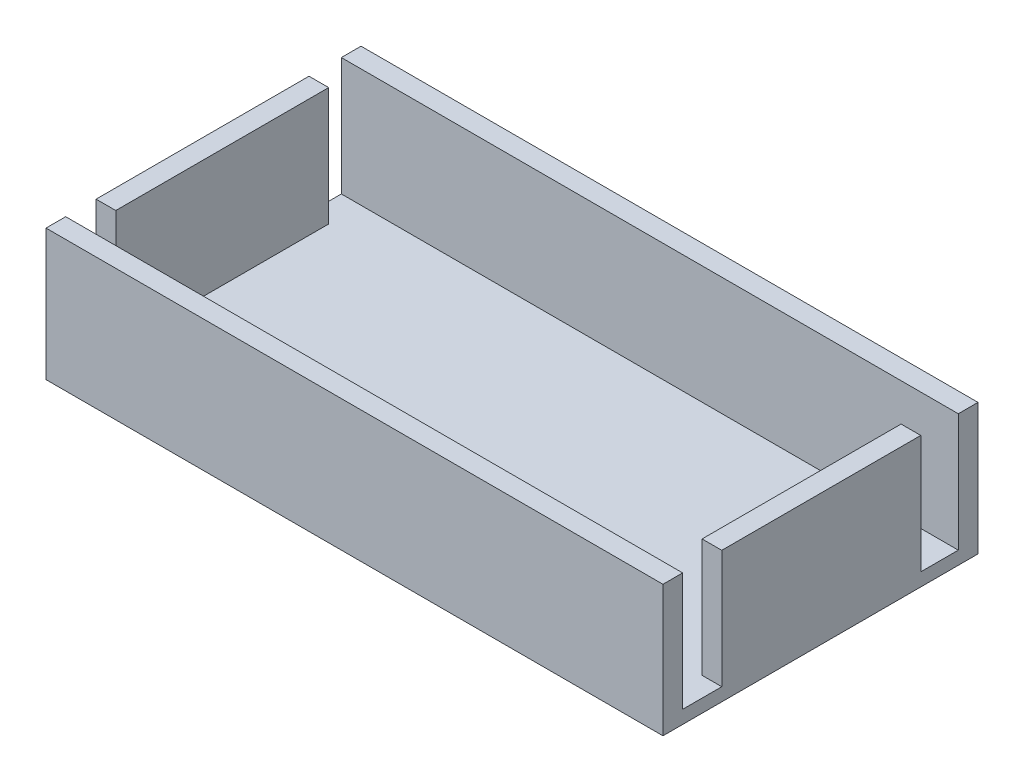
ISO-10303-21;
HEADER;
FILE_DESCRIPTION(('STEP AP214'),'2;1');
FILE_NAME('part.step','',(''),(''),'','','');
FILE_SCHEMA(('AUTOMOTIVE_DESIGN { 1 0 10303 214 1 1 1 1 }'));
ENDSEC;
DATA;
#1=APPLICATION_CONTEXT('core data for automotive mechanical design processes');
#2=APPLICATION_PROTOCOL_DEFINITION('international standard','automotive_design',2000,#1);
#3=PRODUCT_CONTEXT('',#1,'mechanical');
#4=PRODUCT('Part','Part','',(#3));
#5=PRODUCT_RELATED_PRODUCT_CATEGORY('part','',(#4));
#6=PRODUCT_DEFINITION_FORMATION('','',#4);
#7=PRODUCT_DEFINITION_CONTEXT('part definition',#1,'design');
#8=PRODUCT_DEFINITION('design','',#6,#7);
#9=PRODUCT_DEFINITION_SHAPE('','',#8);
#10=(LENGTH_UNIT() NAMED_UNIT(*) SI_UNIT(.MILLI.,.METRE.));
#11=(NAMED_UNIT(*) PLANE_ANGLE_UNIT() SI_UNIT($,.RADIAN.));
#12=(NAMED_UNIT(*) SI_UNIT($,.STERADIAN.) SOLID_ANGLE_UNIT());
#13=UNCERTAINTY_MEASURE_WITH_UNIT(LENGTH_MEASURE(1.E-05),#10,'distance_accuracy_value','');
#14=(GEOMETRIC_REPRESENTATION_CONTEXT(3) GLOBAL_UNCERTAINTY_ASSIGNED_CONTEXT((#13)) GLOBAL_UNIT_ASSIGNED_CONTEXT((#10,
#11,#12)) REPRESENTATION_CONTEXT('',''));
#15=CARTESIAN_POINT('',(0.,0.,0.));
#16=DIRECTION('',(0.,0.,1.));
#17=DIRECTION('',(1.,0.,0.));
#18=AXIS2_PLACEMENT_3D('',#15,#16,#17);
#19=CARTESIAN_POINT('',(0.,10.,0.));
#20=DIRECTION('',(0.,1.,0.));
#21=DIRECTION('',(0.,0.,1.));
#22=AXIS2_PLACEMENT_3D('',#19,#20,#21);
#23=PLANE('',#22);
#24=DIRECTION('',(-1.,0.,0.));
#25=VECTOR('',#24,1.);
#26=CARTESIAN_POINT('',(22.,10.,7.51935703221385));
#27=LINE('',#26,#25);
#28=CARTESIAN_POINT('',(23.5,10.,7.51935703221385));
#29=VERTEX_POINT('',#28);
#30=CARTESIAN_POINT('',(22.,10.,7.51935703221385));
#31=VERTEX_POINT('',#30);
#32=EDGE_CURVE('E172',#29,#31,#27,.T.);
#33=ORIENTED_EDGE('',*,*,#32,.F.);
#34=DIRECTION('',(0.,0.,-1.));
#35=VECTOR('',#34,1.);
#36=CARTESIAN_POINT('',(23.5,10.,-12.));
#37=LINE('',#36,#35);
#38=CARTESIAN_POINT('',(23.5,10.,-7.63898357091009));
#39=VERTEX_POINT('',#38);
#40=EDGE_CURVE('E243',#29,#39,#37,.T.);
#41=ORIENTED_EDGE('',*,*,#40,.T.);
#42=DIRECTION('',(1.,0.,0.));
#43=VECTOR('',#42,1.);
#44=CARTESIAN_POINT('',(22.,10.,-7.63898357091009));
#45=LINE('',#44,#43);
#46=CARTESIAN_POINT('',(22.,10.,-7.63898357091009));
#47=VERTEX_POINT('',#46);
#48=EDGE_CURVE('E181',#47,#39,#45,.T.);
#49=ORIENTED_EDGE('',*,*,#48,.F.);
#50=DIRECTION('',(0.,0.,-1.));
#51=VECTOR('',#50,1.);
#52=CARTESIAN_POINT('',(22.,10.,-10.5));
#53=LINE('',#52,#51);
#54=EDGE_CURVE('E219',#31,#47,#53,.T.);
#55=ORIENTED_EDGE('',*,*,#54,.F.);
#56=EDGE_LOOP('',(#33,#41,#49,#55));
#57=FACE_BOUND('',#56,.T.);
#58=ADVANCED_FACE('F35',(#57),#23,.T.);
#59=DIRECTION('',(1.,0.,0.));
#60=VECTOR('',#59,1.);
#61=CARTESIAN_POINT('',(-22.,10.,-8.03617438464066));
#62=LINE('',#61,#60);
#63=CARTESIAN_POINT('',(-23.5,10.,-8.03617438464066));
#64=VERTEX_POINT('',#63);
#65=CARTESIAN_POINT('',(-22.,10.,-8.03617438464066));
#66=VERTEX_POINT('',#65);
#67=EDGE_CURVE('E185',#64,#66,#62,.T.);
#68=ORIENTED_EDGE('',*,*,#67,.F.);
#69=DIRECTION('',(0.,0.,1.));
#70=VECTOR('',#69,1.);
#71=CARTESIAN_POINT('',(-23.5,10.,-12.));
#72=LINE('',#71,#70);
#73=CARTESIAN_POINT('',(-23.5,10.,8.18484210770087));
#74=VERTEX_POINT('',#73);
#75=EDGE_CURVE('E237',#64,#74,#72,.T.);
#76=ORIENTED_EDGE('',*,*,#75,.T.);
#77=DIRECTION('',(-1.,0.,0.));
#78=VECTOR('',#77,1.);
#79=CARTESIAN_POINT('',(-22.,10.,8.18484210770087));
#80=LINE('',#79,#78);
#81=CARTESIAN_POINT('',(-22.,10.,8.18484210770087));
#82=VERTEX_POINT('',#81);
#83=EDGE_CURVE('E198',#82,#74,#80,.T.);
#84=ORIENTED_EDGE('',*,*,#83,.F.);
#85=DIRECTION('',(0.,0.,1.));
#86=VECTOR('',#85,1.);
#87=CARTESIAN_POINT('',(-22.,10.,-10.5));
#88=LINE('',#87,#86);
#89=EDGE_CURVE('E228',#66,#82,#88,.T.);
#90=ORIENTED_EDGE('',*,*,#89,.F.);
#91=EDGE_LOOP('',(#68,#76,#84,#90));
#92=FACE_BOUND('',#91,.T.);
#93=ADVANCED_FACE('F290',(#92),#23,.T.);
#94=CARTESIAN_POINT('',(23.5,10.,12.));
#95=VERTEX_POINT('',#94);
#96=CARTESIAN_POINT('',(23.5,10.,10.5));
#97=VERTEX_POINT('',#96);
#98=EDGE_CURVE('E241',#95,#97,#37,.T.);
#99=ORIENTED_EDGE('',*,*,#98,.T.);
#100=DIRECTION('',(1.,0.,0.));
#101=VECTOR('',#100,1.);
#102=CARTESIAN_POINT('',(-22.,10.,10.5));
#103=LINE('',#102,#101);
#104=CARTESIAN_POINT('',(-23.5,10.,10.5));
#105=VERTEX_POINT('',#104);
#106=EDGE_CURVE('E163',#105,#97,#103,.T.);
#107=ORIENTED_EDGE('',*,*,#106,.F.);
#108=CARTESIAN_POINT('',(-23.5,10.,12.));
#109=VERTEX_POINT('',#108);
#110=EDGE_CURVE('E232',#105,#109,#72,.T.);
#111=ORIENTED_EDGE('',*,*,#110,.T.);
#112=DIRECTION('',(1.,0.,0.));
#113=VECTOR('',#112,1.);
#114=CARTESIAN_POINT('',(-23.5,10.,12.));
#115=LINE('',#114,#113);
#116=EDGE_CURVE('E236',#109,#95,#115,.T.);
#117=ORIENTED_EDGE('',*,*,#116,.T.);
#118=EDGE_LOOP('',(#99,#107,#111,#117));
#119=FACE_BOUND('',#118,.T.);
#120=ADVANCED_FACE('F284',(#119),#23,.T.);
#121=CARTESIAN_POINT('',(0.,1.,-12.));
#122=DIRECTION('',(0.,0.,-1.));
#123=DIRECTION('',(-1.,0.,0.));
#124=AXIS2_PLACEMENT_3D('',#121,#122,#123);
#125=PLANE('',#124);
#126=DIRECTION('',(1.,0.,0.));
#127=VECTOR('',#126,1.);
#128=CARTESIAN_POINT('',(0.,0.,-12.));
#129=LINE('',#128,#127);
#130=CARTESIAN_POINT('',(-23.5,0.,-12.));
#131=VERTEX_POINT('',#130);
#132=CARTESIAN_POINT('',(23.5,0.,-12.));
#133=VERTEX_POINT('',#132);
#134=EDGE_CURVE('E253',#131,#133,#129,.T.);
#135=ORIENTED_EDGE('',*,*,#134,.F.);
#136=DIRECTION('',(0.,-1.,0.));
#137=VECTOR('',#136,1.);
#138=CARTESIAN_POINT('',(-23.5,1.,-12.));
#139=LINE('',#138,#137);
#140=CARTESIAN_POINT('',(-23.5,10.,-12.));
#141=VERTEX_POINT('',#140);
#142=EDGE_CURVE('E11',#141,#131,#139,.T.);
#143=ORIENTED_EDGE('',*,*,#142,.F.);
#144=DIRECTION('',(-1.,0.,0.));
#145=VECTOR('',#144,1.);
#146=CARTESIAN_POINT('',(-23.5,10.,-12.));
#147=LINE('',#146,#145);
#148=CARTESIAN_POINT('',(23.5,10.,-12.));
#149=VERTEX_POINT('',#148);
#150=EDGE_CURVE('E158',#149,#141,#147,.T.);
#151=ORIENTED_EDGE('',*,*,#150,.F.);
#152=DIRECTION('',(0.,-1.,0.));
#153=VECTOR('',#152,1.);
#154=CARTESIAN_POINT('',(23.5,1.,-12.));
#155=LINE('',#154,#153);
#156=EDGE_CURVE('E264',#149,#133,#155,.T.);
#157=ORIENTED_EDGE('',*,*,#156,.T.);
#158=EDGE_LOOP('',(#135,#143,#151,#157));
#159=FACE_BOUND('',#158,.T.);
#160=ADVANCED_FACE('F37',(#159),#125,.T.);
#161=CARTESIAN_POINT('',(-23.5,1.,0.));
#162=DIRECTION('',(1.,0.,0.));
#163=DIRECTION('',(0.,0.,-1.));
#164=AXIS2_PLACEMENT_3D('',#161,#162,#163);
#165=PLANE('',#164);
#166=ORIENTED_EDGE('',*,*,#75,.F.);
#167=DIRECTION('',(0.,1.,0.));
#168=VECTOR('',#167,1.);
#169=CARTESIAN_POINT('',(-23.5,1.,-8.03617438464066));
#170=LINE('',#169,#168);
#171=CARTESIAN_POINT('',(-23.5,1.,-8.03617438464066));
#172=VERTEX_POINT('',#171);
#173=EDGE_CURVE('E192',#172,#64,#170,.T.);
#174=ORIENTED_EDGE('',*,*,#173,.F.);
#175=DIRECTION('',(0.,0.,1.));
#176=VECTOR('',#175,1.);
#177=CARTESIAN_POINT('',(-23.5,1.,-10.5));
#178=LINE('',#177,#176);
#179=CARTESIAN_POINT('',(-23.5,1.,-10.5));
#180=VERTEX_POINT('',#179);
#181=EDGE_CURVE('E183',#180,#172,#178,.T.);
#182=ORIENTED_EDGE('',*,*,#181,.F.);
#183=DIRECTION('',(0.,1.,0.));
#184=VECTOR('',#183,1.);
#185=CARTESIAN_POINT('',(-23.5,1.,-10.5));
#186=LINE('',#185,#184);
#187=CARTESIAN_POINT('',(-23.5,10.,-10.5));
#188=VERTEX_POINT('',#187);
#189=EDGE_CURVE('E187',#180,#188,#186,.T.);
#190=ORIENTED_EDGE('',*,*,#189,.T.);
#191=EDGE_CURVE('E233',#141,#188,#72,.T.);
#192=ORIENTED_EDGE('',*,*,#191,.F.);
#193=ORIENTED_EDGE('',*,*,#142,.T.);
#194=DIRECTION('',(0.,0.,1.));
#195=VECTOR('',#194,1.);
#196=CARTESIAN_POINT('',(-23.5,0.,0.));
#197=LINE('',#196,#195);
#198=CARTESIAN_POINT('',(-23.5,0.,12.));
#199=VERTEX_POINT('',#198);
#200=EDGE_CURVE('E256',#131,#199,#197,.T.);
#201=ORIENTED_EDGE('',*,*,#200,.T.);
#202=DIRECTION('',(0.,-1.,0.));
#203=VECTOR('',#202,1.);
#204=CARTESIAN_POINT('',(-23.5,1.,12.));
#205=LINE('',#204,#203);
#206=EDGE_CURVE('E43',#109,#199,#205,.T.);
#207=ORIENTED_EDGE('',*,*,#206,.F.);
#208=ORIENTED_EDGE('',*,*,#110,.F.);
#209=DIRECTION('',(0.,1.,0.));
#210=VECTOR('',#209,1.);
#211=CARTESIAN_POINT('',(-23.5,1.,10.5));
#212=LINE('',#211,#210);
#213=CARTESIAN_POINT('',(-23.5,1.,10.5));
#214=VERTEX_POINT('',#213);
#215=EDGE_CURVE('E189',#214,#105,#212,.T.);
#216=ORIENTED_EDGE('',*,*,#215,.F.);
#217=DIRECTION('',(0.,0.,1.));
#218=VECTOR('',#217,1.);
#219=CARTESIAN_POINT('',(-23.5,1.,10.5));
#220=LINE('',#219,#218);
#221=CARTESIAN_POINT('',(-23.5,1.,8.18484210770087));
#222=VERTEX_POINT('',#221);
#223=EDGE_CURVE('E153',#222,#214,#220,.T.);
#224=ORIENTED_EDGE('',*,*,#223,.F.);
#225=DIRECTION('',(0.,1.,0.));
#226=VECTOR('',#225,1.);
#227=CARTESIAN_POINT('',(-23.5,1.,8.18484210770087));
#228=LINE('',#227,#226);
#229=EDGE_CURVE('E203',#222,#74,#228,.T.);
#230=ORIENTED_EDGE('',*,*,#229,.T.);
#231=EDGE_LOOP('',(#166,#174,#182,#190,#192,#193,#201,#207,#208,#216,#224,#230));
#232=FACE_BOUND('',#231,.T.);
#233=ADVANCED_FACE('F293',(#232),#165,.F.);
#234=CARTESIAN_POINT('',(0.,1.,12.));
#235=DIRECTION('',(0.,0.,-1.));
#236=DIRECTION('',(-1.,0.,0.));
#237=AXIS2_PLACEMENT_3D('',#234,#235,#236);
#238=PLANE('',#237);
#239=DIRECTION('',(1.,0.,0.));
#240=VECTOR('',#239,1.);
#241=CARTESIAN_POINT('',(0.,0.,12.));
#242=LINE('',#241,#240);
#243=CARTESIAN_POINT('',(23.5,0.,12.));
#244=VERTEX_POINT('',#243);
#245=EDGE_CURVE('E258',#199,#244,#242,.T.);
#246=ORIENTED_EDGE('',*,*,#245,.T.);
#247=DIRECTION('',(0.,-1.,0.));
#248=VECTOR('',#247,1.);
#249=CARTESIAN_POINT('',(23.5,1.,12.));
#250=LINE('',#249,#248);
#251=EDGE_CURVE('E266',#95,#244,#250,.T.);
#252=ORIENTED_EDGE('',*,*,#251,.F.);
#253=ORIENTED_EDGE('',*,*,#116,.F.);
#254=ORIENTED_EDGE('',*,*,#206,.T.);
#255=EDGE_LOOP('',(#246,#252,#253,#254));
#256=FACE_BOUND('',#255,.T.);
#257=ADVANCED_FACE('F272',(#256),#238,.F.);
#258=CARTESIAN_POINT('',(23.5,1.,0.));
#259=DIRECTION('',(1.,0.,0.));
#260=DIRECTION('',(0.,0.,-1.));
#261=AXIS2_PLACEMENT_3D('',#258,#259,#260);
#262=PLANE('',#261);
#263=DIRECTION('',(0.,1.,0.));
#264=VECTOR('',#263,1.);
#265=CARTESIAN_POINT('',(23.5,1.,7.51935703221385));
#266=LINE('',#265,#264);
#267=CARTESIAN_POINT('',(23.5,1.,7.51935703221385));
#268=VERTEX_POINT('',#267);
#269=EDGE_CURVE('E167',#268,#29,#266,.T.);
#270=ORIENTED_EDGE('',*,*,#269,.F.);
#271=DIRECTION('',(0.,0.,-1.));
#272=VECTOR('',#271,1.);
#273=CARTESIAN_POINT('',(23.5,1.,10.5));
#274=LINE('',#273,#272);
#275=CARTESIAN_POINT('',(23.5,1.,10.5));
#276=VERTEX_POINT('',#275);
#277=EDGE_CURVE('E150',#276,#268,#274,.T.);
#278=ORIENTED_EDGE('',*,*,#277,.F.);
#279=DIRECTION('',(0.,1.,0.));
#280=VECTOR('',#279,1.);
#281=CARTESIAN_POINT('',(23.5,1.,10.5));
#282=LINE('',#281,#280);
#283=EDGE_CURVE('E161',#276,#97,#282,.T.);
#284=ORIENTED_EDGE('',*,*,#283,.T.);
#285=ORIENTED_EDGE('',*,*,#98,.F.);
#286=ORIENTED_EDGE('',*,*,#251,.T.);
#287=DIRECTION('',(0.,0.,1.));
#288=VECTOR('',#287,1.);
#289=CARTESIAN_POINT('',(23.5,0.,0.));
#290=LINE('',#289,#288);
#291=EDGE_CURVE('E261',#133,#244,#290,.T.);
#292=ORIENTED_EDGE('',*,*,#291,.F.);
#293=ORIENTED_EDGE('',*,*,#156,.F.);
#294=CARTESIAN_POINT('',(23.5,10.,-10.5));
#295=VERTEX_POINT('',#294);
#296=EDGE_CURVE('E240',#295,#149,#37,.T.);
#297=ORIENTED_EDGE('',*,*,#296,.F.);
#298=DIRECTION('',(0.,1.,0.));
#299=VECTOR('',#298,1.);
#300=CARTESIAN_POINT('',(23.5,1.,-10.5));
#301=LINE('',#300,#299);
#302=CARTESIAN_POINT('',(23.5,1.,-10.5));
#303=VERTEX_POINT('',#302);
#304=EDGE_CURVE('E216',#303,#295,#301,.T.);
#305=ORIENTED_EDGE('',*,*,#304,.F.);
#306=DIRECTION('',(0.,0.,-1.));
#307=VECTOR('',#306,1.);
#308=CARTESIAN_POINT('',(23.5,1.,-10.5));
#309=LINE('',#308,#307);
#310=CARTESIAN_POINT('',(23.5,1.,-7.63898357091009));
#311=VERTEX_POINT('',#310);
#312=EDGE_CURVE('E210',#311,#303,#309,.T.);
#313=ORIENTED_EDGE('',*,*,#312,.F.);
#314=DIRECTION('',(0.,1.,0.));
#315=VECTOR('',#314,1.);
#316=CARTESIAN_POINT('',(23.5,1.,-7.63898357091009));
#317=LINE('',#316,#315);
#318=EDGE_CURVE('E220',#311,#39,#317,.T.);
#319=ORIENTED_EDGE('',*,*,#318,.T.);
#320=ORIENTED_EDGE('',*,*,#40,.F.);
#321=EDGE_LOOP('',(#270,#278,#284,#285,#286,#292,#293,#297,#305,#313,#319,#320));
#322=FACE_BOUND('',#321,.T.);
#323=ADVANCED_FACE('F170',(#322),#262,.T.);
#324=CARTESIAN_POINT('',(0.,0.,0.));
#325=DIRECTION('',(0.,1.,0.));
#326=DIRECTION('',(0.,0.,1.));
#327=AXIS2_PLACEMENT_3D('',#324,#325,#326);
#328=PLANE('',#327);
#329=ORIENTED_EDGE('',*,*,#134,.T.);
#330=ORIENTED_EDGE('',*,*,#291,.T.);
#331=ORIENTED_EDGE('',*,*,#245,.F.);
#332=ORIENTED_EDGE('',*,*,#200,.F.);
#333=EDGE_LOOP('',(#329,#330,#331,#332));
#334=FACE_BOUND('',#333,.T.);
#335=ADVANCED_FACE('F277',(#334),#328,.F.);
#336=ORIENTED_EDGE('',*,*,#191,.T.);
#337=DIRECTION('',(-1.,0.,0.));
#338=VECTOR('',#337,1.);
#339=CARTESIAN_POINT('',(-22.,10.,-10.5));
#340=LINE('',#339,#338);
#341=EDGE_CURVE('E226',#295,#188,#340,.T.);
#342=ORIENTED_EDGE('',*,*,#341,.F.);
#343=ORIENTED_EDGE('',*,*,#296,.T.);
#344=ORIENTED_EDGE('',*,*,#150,.T.);
#345=EDGE_LOOP('',(#336,#342,#343,#344));
#346=FACE_BOUND('',#345,.T.);
#347=ADVANCED_FACE('F316',(#346),#23,.T.);
#348=CARTESIAN_POINT('',(22.,10.,-10.5));
#349=DIRECTION('',(-1.,0.,0.));
#350=DIRECTION('',(0.,0.,1.));
#351=AXIS2_PLACEMENT_3D('',#348,#349,#350);
#352=PLANE('',#351);
#353=DIRECTION('',(0.,1.,0.));
#354=VECTOR('',#353,1.);
#355=CARTESIAN_POINT('',(22.,1.,7.51935703221385));
#356=LINE('',#355,#354);
#357=CARTESIAN_POINT('',(22.,1.,7.51935703221385));
#358=VERTEX_POINT('',#357);
#359=EDGE_CURVE('E178',#358,#31,#356,.T.);
#360=ORIENTED_EDGE('',*,*,#359,.T.);
#361=ORIENTED_EDGE('',*,*,#54,.T.);
#362=DIRECTION('',(0.,1.,0.));
#363=VECTOR('',#362,1.);
#364=CARTESIAN_POINT('',(22.,1.,-7.63898357091009));
#365=LINE('',#364,#363);
#366=CARTESIAN_POINT('',(22.,1.,-7.63898357091009));
#367=VERTEX_POINT('',#366);
#368=EDGE_CURVE('E213',#367,#47,#365,.T.);
#369=ORIENTED_EDGE('',*,*,#368,.F.);
#370=DIRECTION('',(0.,0.,1.));
#371=VECTOR('',#370,1.);
#372=CARTESIAN_POINT('',(22.,1.,0.));
#373=LINE('',#372,#371);
#374=EDGE_CURVE('E250',#367,#358,#373,.T.);
#375=ORIENTED_EDGE('',*,*,#374,.T.);
#376=EDGE_LOOP('',(#360,#361,#369,#375));
#377=FACE_BOUND('',#376,.T.);
#378=ADVANCED_FACE('F324',(#377),#352,.T.);
#379=CARTESIAN_POINT('',(-22.,10.,-10.5));
#380=DIRECTION('',(0.,0.,1.));
#381=DIRECTION('',(1.,0.,0.));
#382=AXIS2_PLACEMENT_3D('',#379,#380,#381);
#383=PLANE('',#382);
#384=ORIENTED_EDGE('',*,*,#341,.T.);
#385=ORIENTED_EDGE('',*,*,#189,.F.);
#386=DIRECTION('',(1.,0.,0.));
#387=VECTOR('',#386,1.);
#388=CARTESIAN_POINT('',(0.,1.,-10.5));
#389=LINE('',#388,#387);
#390=EDGE_CURVE('E248',#180,#303,#389,.T.);
#391=ORIENTED_EDGE('',*,*,#390,.T.);
#392=ORIENTED_EDGE('',*,*,#304,.T.);
#393=EDGE_LOOP('',(#384,#385,#391,#392));
#394=FACE_BOUND('',#393,.T.);
#395=ADVANCED_FACE('F330',(#394),#383,.T.);
#396=CARTESIAN_POINT('',(-22.,10.,-10.5));
#397=DIRECTION('',(1.,0.,0.));
#398=DIRECTION('',(0.,0.,-1.));
#399=AXIS2_PLACEMENT_3D('',#396,#397,#398);
#400=PLANE('',#399);
#401=DIRECTION('',(0.,1.,0.));
#402=VECTOR('',#401,1.);
#403=CARTESIAN_POINT('',(-22.,1.,-8.03617438464066));
#404=LINE('',#403,#402);
#405=CARTESIAN_POINT('',(-22.,1.,-8.03617438464066));
#406=VERTEX_POINT('',#405);
#407=EDGE_CURVE('E175',#406,#66,#404,.T.);
#408=ORIENTED_EDGE('',*,*,#407,.T.);
#409=ORIENTED_EDGE('',*,*,#89,.T.);
#410=DIRECTION('',(0.,1.,0.));
#411=VECTOR('',#410,1.);
#412=CARTESIAN_POINT('',(-22.,1.,8.18484210770087));
#413=LINE('',#412,#411);
#414=CARTESIAN_POINT('',(-22.,1.,8.18484210770087));
#415=VERTEX_POINT('',#414);
#416=EDGE_CURVE('E200',#415,#82,#413,.T.);
#417=ORIENTED_EDGE('',*,*,#416,.F.);
#418=DIRECTION('',(0.,0.,-1.));
#419=VECTOR('',#418,1.);
#420=CARTESIAN_POINT('',(-22.,1.,0.));
#421=LINE('',#420,#419);
#422=EDGE_CURVE('E157',#415,#406,#421,.T.);
#423=ORIENTED_EDGE('',*,*,#422,.T.);
#424=EDGE_LOOP('',(#408,#409,#417,#423));
#425=FACE_BOUND('',#424,.T.);
#426=ADVANCED_FACE('F299',(#425),#400,.T.);
#427=CARTESIAN_POINT('',(-22.,10.,10.5));
#428=DIRECTION('',(0.,0.,-1.));
#429=DIRECTION('',(-1.,0.,0.));
#430=AXIS2_PLACEMENT_3D('',#427,#428,#429);
#431=PLANE('',#430);
#432=ORIENTED_EDGE('',*,*,#106,.T.);
#433=ORIENTED_EDGE('',*,*,#283,.F.);
#434=DIRECTION('',(-1.,0.,0.));
#435=VECTOR('',#434,1.);
#436=CARTESIAN_POINT('',(0.,1.,10.5));
#437=LINE('',#436,#435);
#438=EDGE_CURVE('E146',#276,#214,#437,.T.);
#439=ORIENTED_EDGE('',*,*,#438,.T.);
#440=ORIENTED_EDGE('',*,*,#215,.T.);
#441=EDGE_LOOP('',(#432,#433,#439,#440));
#442=FACE_BOUND('',#441,.T.);
#443=ADVANCED_FACE('F162',(#442),#431,.T.);
#444=CARTESIAN_POINT('',(0.,1.,0.));
#445=DIRECTION('',(0.,1.,0.));
#446=DIRECTION('',(0.,0.,1.));
#447=AXIS2_PLACEMENT_3D('',#444,#445,#446);
#448=PLANE('',#447);
#449=ORIENTED_EDGE('',*,*,#374,.F.);
#450=DIRECTION('',(1.,0.,0.));
#451=VECTOR('',#450,1.);
#452=CARTESIAN_POINT('',(22.,1.,-7.63898357091009));
#453=LINE('',#452,#451);
#454=EDGE_CURVE('E207',#367,#311,#453,.T.);
#455=ORIENTED_EDGE('',*,*,#454,.T.);
#456=ORIENTED_EDGE('',*,*,#312,.T.);
#457=ORIENTED_EDGE('',*,*,#390,.F.);
#458=ORIENTED_EDGE('',*,*,#181,.T.);
#459=DIRECTION('',(1.,0.,0.));
#460=VECTOR('',#459,1.);
#461=CARTESIAN_POINT('',(-22.,1.,-8.03617438464066));
#462=LINE('',#461,#460);
#463=EDGE_CURVE('E50',#172,#406,#462,.T.);
#464=ORIENTED_EDGE('',*,*,#463,.T.);
#465=ORIENTED_EDGE('',*,*,#422,.F.);
#466=DIRECTION('',(-1.,0.,0.));
#467=VECTOR('',#466,1.);
#468=CARTESIAN_POINT('',(-22.,1.,8.18484210770087));
#469=LINE('',#468,#467);
#470=EDGE_CURVE('E196',#415,#222,#469,.T.);
#471=ORIENTED_EDGE('',*,*,#470,.T.);
#472=ORIENTED_EDGE('',*,*,#223,.T.);
#473=ORIENTED_EDGE('',*,*,#438,.F.);
#474=ORIENTED_EDGE('',*,*,#277,.T.);
#475=DIRECTION('',(-1.,0.,0.));
#476=VECTOR('',#475,1.);
#477=CARTESIAN_POINT('',(22.,1.,7.51935703221385));
#478=LINE('',#477,#476);
#479=EDGE_CURVE('E57',#268,#358,#478,.T.);
#480=ORIENTED_EDGE('',*,*,#479,.T.);
#481=EDGE_LOOP('',(#449,#455,#456,#457,#458,#464,#465,#471,#472,#473,#474,#480));
#482=FACE_BOUND('',#481,.T.);
#483=ADVANCED_FACE('F148',(#482),#448,.T.);
#484=CARTESIAN_POINT('',(22.,1.,-7.63898357091009));
#485=DIRECTION('',(0.,0.,1.));
#486=DIRECTION('',(1.,0.,0.));
#487=AXIS2_PLACEMENT_3D('',#484,#485,#486);
#488=PLANE('',#487);
#489=ORIENTED_EDGE('',*,*,#48,.T.);
#490=ORIENTED_EDGE('',*,*,#318,.F.);
#491=ORIENTED_EDGE('',*,*,#454,.F.);
#492=ORIENTED_EDGE('',*,*,#368,.T.);
#493=EDGE_LOOP('',(#489,#490,#491,#492));
#494=FACE_BOUND('',#493,.T.);
#495=ADVANCED_FACE('F311',(#494),#488,.F.);
#496=CARTESIAN_POINT('',(-22.,1.,8.18484210770087));
#497=DIRECTION('',(0.,0.,-1.));
#498=DIRECTION('',(-1.,0.,0.));
#499=AXIS2_PLACEMENT_3D('',#496,#497,#498);
#500=PLANE('',#499);
#501=ORIENTED_EDGE('',*,*,#83,.T.);
#502=ORIENTED_EDGE('',*,*,#229,.F.);
#503=ORIENTED_EDGE('',*,*,#470,.F.);
#504=ORIENTED_EDGE('',*,*,#416,.T.);
#505=EDGE_LOOP('',(#501,#502,#503,#504));
#506=FACE_BOUND('',#505,.T.);
#507=ADVANCED_FACE('F296',(#506),#500,.F.);
#508=CARTESIAN_POINT('',(-22.,1.,-8.03617438464066));
#509=DIRECTION('',(0.,0.,1.));
#510=DIRECTION('',(1.,0.,0.));
#511=AXIS2_PLACEMENT_3D('',#508,#509,#510);
#512=PLANE('',#511);
#513=ORIENTED_EDGE('',*,*,#67,.T.);
#514=ORIENTED_EDGE('',*,*,#407,.F.);
#515=ORIENTED_EDGE('',*,*,#463,.F.);
#516=ORIENTED_EDGE('',*,*,#173,.T.);
#517=EDGE_LOOP('',(#513,#514,#515,#516));
#518=FACE_BOUND('',#517,.T.);
#519=ADVANCED_FACE('F301',(#518),#512,.F.);
#520=CARTESIAN_POINT('',(22.,1.,7.51935703221385));
#521=DIRECTION('',(0.,0.,-1.));
#522=DIRECTION('',(-1.,0.,0.));
#523=AXIS2_PLACEMENT_3D('',#520,#521,#522);
#524=PLANE('',#523);
#525=ORIENTED_EDGE('',*,*,#32,.T.);
#526=ORIENTED_EDGE('',*,*,#359,.F.);
#527=ORIENTED_EDGE('',*,*,#479,.F.);
#528=ORIENTED_EDGE('',*,*,#269,.T.);
#529=EDGE_LOOP('',(#525,#526,#527,#528));
#530=FACE_BOUND('',#529,.T.);
#531=ADVANCED_FACE('F303',(#530),#524,.F.);
#532=CLOSED_SHELL('',(#58,#93,#120,#160,#233,#257,#323,#335,#347,#378,#395,#426,#443,#483,#495,
#507,#519,#531));
#533=MANIFOLD_SOLID_BREP('B2',#532);
#534=ADVANCED_BREP_SHAPE_REPRESENTATION('',(#18,#533),#14);
#535=SHAPE_DEFINITION_REPRESENTATION(#9,#534);
ENDSEC;
END-ISO-10303-21;
